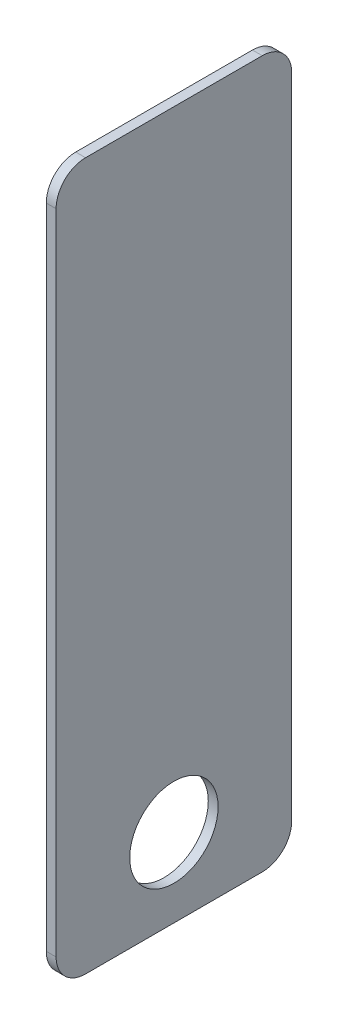
ISO-10303-21;
HEADER;
FILE_DESCRIPTION(('STEP AP214'),'2;1');
FILE_NAME('part.step','',(''),(''),'','','');
FILE_SCHEMA(('AUTOMOTIVE_DESIGN { 1 0 10303 214 1 1 1 1 }'));
ENDSEC;
DATA;
#1=APPLICATION_CONTEXT('core data for automotive mechanical design processes');
#2=APPLICATION_PROTOCOL_DEFINITION('international standard','automotive_design',2000,#1);
#3=PRODUCT_CONTEXT('',#1,'mechanical');
#4=PRODUCT('Part','Part','',(#3));
#5=PRODUCT_RELATED_PRODUCT_CATEGORY('part','',(#4));
#6=PRODUCT_DEFINITION_FORMATION('','',#4);
#7=PRODUCT_DEFINITION_CONTEXT('part definition',#1,'design');
#8=PRODUCT_DEFINITION('design','',#6,#7);
#9=PRODUCT_DEFINITION_SHAPE('','',#8);
#10=(LENGTH_UNIT() NAMED_UNIT(*) SI_UNIT(.MILLI.,.METRE.));
#11=(NAMED_UNIT(*) PLANE_ANGLE_UNIT() SI_UNIT($,.RADIAN.));
#12=(NAMED_UNIT(*) SI_UNIT($,.STERADIAN.) SOLID_ANGLE_UNIT());
#13=UNCERTAINTY_MEASURE_WITH_UNIT(LENGTH_MEASURE(1.E-05),#10,'distance_accuracy_value','');
#14=(GEOMETRIC_REPRESENTATION_CONTEXT(3) GLOBAL_UNCERTAINTY_ASSIGNED_CONTEXT((#13)) GLOBAL_UNIT_ASSIGNED_CONTEXT((#10,
#11,#12)) REPRESENTATION_CONTEXT('',''));
#15=CARTESIAN_POINT('',(0.,0.,0.));
#16=DIRECTION('',(0.,0.,1.));
#17=DIRECTION('',(1.,0.,0.));
#18=AXIS2_PLACEMENT_3D('',#15,#16,#17);
#19=CARTESIAN_POINT('',(3.175,0.,0.));
#20=DIRECTION('',(1.,0.,0.));
#21=DIRECTION('',(0.,0.,-1.));
#22=AXIS2_PLACEMENT_3D('',#19,#20,#21);
#23=PLANE('',#22);
#24=DIRECTION('',(0.,0.,-1.));
#25=VECTOR('',#24,1.);
#26=CARTESIAN_POINT('',(3.175,-114.3,38.1));
#27=LINE('',#26,#25);
#28=CARTESIAN_POINT('',(3.175,-114.3,28.575));
#29=VERTEX_POINT('',#28);
#30=CARTESIAN_POINT('',(3.175,-114.3,-28.575));
#31=VERTEX_POINT('',#30);
#32=EDGE_CURVE('E168',#29,#31,#27,.T.);
#33=ORIENTED_EDGE('',*,*,#32,.T.);
#34=CARTESIAN_POINT('',(3.175,-104.775,-28.575));
#35=DIRECTION('',(1.,0.,0.));
#36=DIRECTION('',(0.,0.,-1.));
#37=AXIS2_PLACEMENT_3D('',#34,#35,#36);
#38=CIRCLE('',#37,9.525);
#39=CARTESIAN_POINT('',(3.175,-104.775,-38.1));
#40=VERTEX_POINT('',#39);
#41=EDGE_CURVE('E148',#31,#40,#38,.T.);
#42=ORIENTED_EDGE('',*,*,#41,.T.);
#43=DIRECTION('',(0.,1.,0.));
#44=VECTOR('',#43,1.);
#45=CARTESIAN_POINT('',(3.175,114.3,-38.1));
#46=LINE('',#45,#44);
#47=CARTESIAN_POINT('',(3.175,104.775,-38.1));
#48=VERTEX_POINT('',#47);
#49=EDGE_CURVE('E118',#40,#48,#46,.T.);
#50=ORIENTED_EDGE('',*,*,#49,.T.);
#51=CARTESIAN_POINT('',(3.175,104.775,-28.575));
#52=DIRECTION('',(1.,0.,0.));
#53=DIRECTION('',(0.,0.,-1.));
#54=AXIS2_PLACEMENT_3D('',#51,#52,#53);
#55=CIRCLE('',#54,9.525);
#56=CARTESIAN_POINT('',(3.175,114.3,-28.575));
#57=VERTEX_POINT('',#56);
#58=EDGE_CURVE('E54',#48,#57,#55,.T.);
#59=ORIENTED_EDGE('',*,*,#58,.T.);
#60=DIRECTION('',(0.,0.,1.));
#61=VECTOR('',#60,1.);
#62=CARTESIAN_POINT('',(3.175,114.3,38.1));
#63=LINE('',#62,#61);
#64=CARTESIAN_POINT('',(3.175,114.3,28.575));
#65=VERTEX_POINT('',#64);
#66=EDGE_CURVE('E135',#57,#65,#63,.T.);
#67=ORIENTED_EDGE('',*,*,#66,.T.);
#68=CARTESIAN_POINT('',(3.175,104.775,28.575));
#69=DIRECTION('',(1.,0.,0.));
#70=DIRECTION('',(0.,0.,-1.));
#71=AXIS2_PLACEMENT_3D('',#68,#69,#70);
#72=CIRCLE('',#71,9.525);
#73=CARTESIAN_POINT('',(3.175,104.775,38.1));
#74=VERTEX_POINT('',#73);
#75=EDGE_CURVE('E143',#65,#74,#72,.T.);
#76=ORIENTED_EDGE('',*,*,#75,.T.);
#77=DIRECTION('',(0.,-1.,0.));
#78=VECTOR('',#77,1.);
#79=CARTESIAN_POINT('',(3.175,114.3,38.1));
#80=LINE('',#79,#78);
#81=CARTESIAN_POINT('',(3.175,-104.775,38.1));
#82=VERTEX_POINT('',#81);
#83=EDGE_CURVE('E129',#74,#82,#80,.T.);
#84=ORIENTED_EDGE('',*,*,#83,.T.);
#85=CARTESIAN_POINT('',(3.175,-104.775,28.575));
#86=DIRECTION('',(1.,0.,0.));
#87=DIRECTION('',(0.,0.,-1.));
#88=AXIS2_PLACEMENT_3D('',#85,#86,#87);
#89=CIRCLE('',#88,9.525);
#90=EDGE_CURVE('E146',#82,#29,#89,.T.);
#91=ORIENTED_EDGE('',*,*,#90,.T.);
#92=EDGE_LOOP('',(#33,#42,#50,#59,#67,#76,#84,#91));
#93=FACE_BOUND('',#92,.T.);
#94=CARTESIAN_POINT('',(3.175,-88.9,0.));
#95=DIRECTION('',(1.,0.,0.));
#96=DIRECTION('',(0.,0.,-1.));
#97=AXIS2_PLACEMENT_3D('',#94,#95,#96);
#98=CIRCLE('',#97,14.2875);
#99=CARTESIAN_POINT('',(3.175,-88.9,-14.2875));
#100=VERTEX_POINT('',#99);
#101=EDGE_CURVE('E174',#100,#100,#98,.T.);
#102=ORIENTED_EDGE('',*,*,#101,.F.);
#103=EDGE_LOOP('',(#102));
#104=FACE_BOUND('',#103,.T.);
#105=ADVANCED_FACE('F33',(#93,#104),#23,.T.);
#106=CARTESIAN_POINT('',(0.,0.,0.));
#107=DIRECTION('',(1.,0.,0.));
#108=DIRECTION('',(0.,0.,-1.));
#109=AXIS2_PLACEMENT_3D('',#106,#107,#108);
#110=PLANE('',#109);
#111=DIRECTION('',(0.,1.,0.));
#112=VECTOR('',#111,1.);
#113=CARTESIAN_POINT('',(0.,114.3,-38.1));
#114=LINE('',#113,#112);
#115=CARTESIAN_POINT('',(0.,-104.775,-38.1));
#116=VERTEX_POINT('',#115);
#117=CARTESIAN_POINT('',(0.,104.775,-38.1));
#118=VERTEX_POINT('',#117);
#119=EDGE_CURVE('E116',#116,#118,#114,.T.);
#120=ORIENTED_EDGE('',*,*,#119,.F.);
#121=CARTESIAN_POINT('',(0.,-104.775,-28.575));
#122=DIRECTION('',(1.,0.,0.));
#123=DIRECTION('',(0.,0.,-1.));
#124=AXIS2_PLACEMENT_3D('',#121,#122,#123);
#125=CIRCLE('',#124,9.525);
#126=CARTESIAN_POINT('',(0.,-114.3,-28.575));
#127=VERTEX_POINT('',#126);
#128=EDGE_CURVE('E99',#116,#127,#125,.F.);
#129=ORIENTED_EDGE('',*,*,#128,.T.);
#130=DIRECTION('',(0.,0.,-1.));
#131=VECTOR('',#130,1.);
#132=CARTESIAN_POINT('',(0.,-114.3,38.1));
#133=LINE('',#132,#131);
#134=CARTESIAN_POINT('',(0.,-114.3,28.575));
#135=VERTEX_POINT('',#134);
#136=EDGE_CURVE('E127',#135,#127,#133,.T.);
#137=ORIENTED_EDGE('',*,*,#136,.F.);
#138=CARTESIAN_POINT('',(0.,-104.775,28.575));
#139=DIRECTION('',(1.,0.,0.));
#140=DIRECTION('',(0.,0.,-1.));
#141=AXIS2_PLACEMENT_3D('',#138,#139,#140);
#142=CIRCLE('',#141,9.525);
#143=CARTESIAN_POINT('',(0.,-104.775,38.1));
#144=VERTEX_POINT('',#143);
#145=EDGE_CURVE('E110',#135,#144,#142,.F.);
#146=ORIENTED_EDGE('',*,*,#145,.T.);
#147=DIRECTION('',(0.,-1.,0.));
#148=VECTOR('',#147,1.);
#149=CARTESIAN_POINT('',(0.,114.3,38.1));
#150=LINE('',#149,#148);
#151=CARTESIAN_POINT('',(0.,104.775,38.1));
#152=VERTEX_POINT('',#151);
#153=EDGE_CURVE('E131',#152,#144,#150,.T.);
#154=ORIENTED_EDGE('',*,*,#153,.F.);
#155=CARTESIAN_POINT('',(0.,104.775,28.575));
#156=DIRECTION('',(1.,0.,0.));
#157=DIRECTION('',(0.,0.,-1.));
#158=AXIS2_PLACEMENT_3D('',#155,#156,#157);
#159=CIRCLE('',#158,9.525);
#160=CARTESIAN_POINT('',(0.,114.3,28.575));
#161=VERTEX_POINT('',#160);
#162=EDGE_CURVE('E119',#152,#161,#159,.F.);
#163=ORIENTED_EDGE('',*,*,#162,.T.);
#164=DIRECTION('',(0.,0.,1.));
#165=VECTOR('',#164,1.);
#166=CARTESIAN_POINT('',(0.,114.3,38.1));
#167=LINE('',#166,#165);
#168=CARTESIAN_POINT('',(0.,114.3,-28.575));
#169=VERTEX_POINT('',#168);
#170=EDGE_CURVE('E126',#169,#161,#167,.T.);
#171=ORIENTED_EDGE('',*,*,#170,.F.);
#172=CARTESIAN_POINT('',(0.,104.775,-28.575));
#173=DIRECTION('',(1.,0.,0.));
#174=DIRECTION('',(0.,0.,-1.));
#175=AXIS2_PLACEMENT_3D('',#172,#173,#174);
#176=CIRCLE('',#175,9.525);
#177=EDGE_CURVE('E125',#169,#118,#176,.F.);
#178=ORIENTED_EDGE('',*,*,#177,.T.);
#179=EDGE_LOOP('',(#120,#129,#137,#146,#154,#163,#171,#178));
#180=FACE_BOUND('',#179,.T.);
#181=CARTESIAN_POINT('',(0.,-88.9,0.));
#182=DIRECTION('',(1.,0.,0.));
#183=DIRECTION('',(0.,0.,-1.));
#184=AXIS2_PLACEMENT_3D('',#181,#182,#183);
#185=CIRCLE('',#184,14.2875);
#186=CARTESIAN_POINT('',(0.,-88.9,-14.2875));
#187=VERTEX_POINT('',#186);
#188=EDGE_CURVE('E176',#187,#187,#185,.T.);
#189=ORIENTED_EDGE('',*,*,#188,.T.);
#190=EDGE_LOOP('',(#189));
#191=FACE_BOUND('',#190,.T.);
#192=ADVANCED_FACE('F122',(#180,#191),#110,.F.);
#193=CARTESIAN_POINT('',(3.175,114.3,38.1));
#194=DIRECTION('',(0.,0.,-1.));
#195=DIRECTION('',(-1.,0.,0.));
#196=AXIS2_PLACEMENT_3D('',#193,#194,#195);
#197=PLANE('',#196);
#198=ORIENTED_EDGE('',*,*,#153,.T.);
#199=DIRECTION('',(-1.,0.,0.));
#200=VECTOR('',#199,1.);
#201=CARTESIAN_POINT('',(3.175,-104.775,38.1));
#202=LINE('',#201,#200);
#203=EDGE_CURVE('E153',#144,#82,#202,.F.);
#204=ORIENTED_EDGE('',*,*,#203,.T.);
#205=ORIENTED_EDGE('',*,*,#83,.F.);
#206=DIRECTION('',(-1.,0.,0.));
#207=VECTOR('',#206,1.);
#208=CARTESIAN_POINT('',(3.175,104.775,38.1));
#209=LINE('',#208,#207);
#210=EDGE_CURVE('E150',#74,#152,#209,.T.);
#211=ORIENTED_EDGE('',*,*,#210,.T.);
#212=EDGE_LOOP('',(#198,#204,#205,#211));
#213=FACE_BOUND('',#212,.T.);
#214=ADVANCED_FACE('F159',(#213),#197,.F.);
#215=CARTESIAN_POINT('',(3.175,-114.3,38.1));
#216=DIRECTION('',(0.,1.,0.));
#217=DIRECTION('',(0.,0.,1.));
#218=AXIS2_PLACEMENT_3D('',#215,#216,#217);
#219=PLANE('',#218);
#220=ORIENTED_EDGE('',*,*,#136,.T.);
#221=DIRECTION('',(-1.,0.,0.));
#222=VECTOR('',#221,1.);
#223=CARTESIAN_POINT('',(3.175,-114.3,-28.575));
#224=LINE('',#223,#222);
#225=EDGE_CURVE('E104',#127,#31,#224,.F.);
#226=ORIENTED_EDGE('',*,*,#225,.T.);
#227=ORIENTED_EDGE('',*,*,#32,.F.);
#228=DIRECTION('',(-1.,0.,0.));
#229=VECTOR('',#228,1.);
#230=CARTESIAN_POINT('',(3.175,-114.3,28.575));
#231=LINE('',#230,#229);
#232=EDGE_CURVE('E109',#29,#135,#231,.T.);
#233=ORIENTED_EDGE('',*,*,#232,.T.);
#234=EDGE_LOOP('',(#220,#226,#227,#233));
#235=FACE_BOUND('',#234,.T.);
#236=ADVANCED_FACE('F173',(#235),#219,.F.);
#237=CARTESIAN_POINT('',(3.175,114.3,-38.1));
#238=DIRECTION('',(0.,0.,1.));
#239=DIRECTION('',(0.,-1.,0.));
#240=AXIS2_PLACEMENT_3D('',#237,#238,#239);
#241=PLANE('',#240);
#242=ORIENTED_EDGE('',*,*,#49,.F.);
#243=DIRECTION('',(-1.,0.,0.));
#244=VECTOR('',#243,1.);
#245=CARTESIAN_POINT('',(3.175,-104.775,-38.1));
#246=LINE('',#245,#244);
#247=EDGE_CURVE('E103',#40,#116,#246,.T.);
#248=ORIENTED_EDGE('',*,*,#247,.T.);
#249=ORIENTED_EDGE('',*,*,#119,.T.);
#250=DIRECTION('',(-1.,0.,0.));
#251=VECTOR('',#250,1.);
#252=CARTESIAN_POINT('',(3.175,104.775,-38.1));
#253=LINE('',#252,#251);
#254=EDGE_CURVE('E120',#118,#48,#253,.F.);
#255=ORIENTED_EDGE('',*,*,#254,.T.);
#256=EDGE_LOOP('',(#242,#248,#249,#255));
#257=FACE_BOUND('',#256,.T.);
#258=ADVANCED_FACE('F115',(#257),#241,.F.);
#259=CARTESIAN_POINT('',(3.175,114.3,38.1));
#260=DIRECTION('',(0.,-1.,0.));
#261=DIRECTION('',(0.,0.,-1.));
#262=AXIS2_PLACEMENT_3D('',#259,#260,#261);
#263=PLANE('',#262);
#264=ORIENTED_EDGE('',*,*,#66,.F.);
#265=DIRECTION('',(-1.,0.,0.));
#266=VECTOR('',#265,1.);
#267=CARTESIAN_POINT('',(3.175,114.3,-28.575));
#268=LINE('',#267,#266);
#269=EDGE_CURVE('E11',#57,#169,#268,.T.);
#270=ORIENTED_EDGE('',*,*,#269,.T.);
#271=ORIENTED_EDGE('',*,*,#170,.T.);
#272=DIRECTION('',(-1.,0.,0.));
#273=VECTOR('',#272,1.);
#274=CARTESIAN_POINT('',(3.175,114.3,28.575));
#275=LINE('',#274,#273);
#276=EDGE_CURVE('E41',#161,#65,#275,.F.);
#277=ORIENTED_EDGE('',*,*,#276,.T.);
#278=EDGE_LOOP('',(#264,#270,#271,#277));
#279=FACE_BOUND('',#278,.T.);
#280=ADVANCED_FACE('F187',(#279),#263,.F.);
#281=CARTESIAN_POINT('',(3.175,-88.9,0.));
#282=DIRECTION('',(-1.,0.,0.));
#283=DIRECTION('',(0.,0.,1.));
#284=AXIS2_PLACEMENT_3D('',#281,#282,#283);
#285=CYLINDRICAL_SURFACE('',#284,14.2875);
#286=ORIENTED_EDGE('',*,*,#101,.T.);
#287=EDGE_LOOP('',(#286));
#288=FACE_BOUND('',#287,.T.);
#289=ORIENTED_EDGE('',*,*,#188,.F.);
#290=EDGE_LOOP('',(#289));
#291=FACE_BOUND('',#290,.T.);
#292=ADVANCED_FACE('F185',(#288,#291),#285,.F.);
#293=CARTESIAN_POINT('',(3.175,-104.775,-28.575));
#294=DIRECTION('',(-1.,0.,0.));
#295=DIRECTION('',(0.,0.,1.));
#296=AXIS2_PLACEMENT_3D('',#293,#294,#295);
#297=CYLINDRICAL_SURFACE('',#296,9.525);
#298=ORIENTED_EDGE('',*,*,#41,.F.);
#299=ORIENTED_EDGE('',*,*,#225,.F.);
#300=ORIENTED_EDGE('',*,*,#128,.F.);
#301=ORIENTED_EDGE('',*,*,#247,.F.);
#302=EDGE_LOOP('',(#298,#299,#300,#301));
#303=FACE_BOUND('',#302,.T.);
#304=ADVANCED_FACE('F102',(#303),#297,.T.);
#305=CARTESIAN_POINT('',(3.175,-104.775,28.575));
#306=DIRECTION('',(-1.,0.,0.));
#307=DIRECTION('',(0.,0.,1.));
#308=AXIS2_PLACEMENT_3D('',#305,#306,#307);
#309=CYLINDRICAL_SURFACE('',#308,9.525);
#310=ORIENTED_EDGE('',*,*,#90,.F.);
#311=ORIENTED_EDGE('',*,*,#203,.F.);
#312=ORIENTED_EDGE('',*,*,#145,.F.);
#313=ORIENTED_EDGE('',*,*,#232,.F.);
#314=EDGE_LOOP('',(#310,#311,#312,#313));
#315=FACE_BOUND('',#314,.T.);
#316=ADVANCED_FACE('F171',(#315),#309,.T.);
#317=CARTESIAN_POINT('',(3.175,104.775,-28.575));
#318=DIRECTION('',(-1.,0.,0.));
#319=DIRECTION('',(0.,0.,1.));
#320=AXIS2_PLACEMENT_3D('',#317,#318,#319);
#321=CYLINDRICAL_SURFACE('',#320,9.525);
#322=ORIENTED_EDGE('',*,*,#58,.F.);
#323=ORIENTED_EDGE('',*,*,#254,.F.);
#324=ORIENTED_EDGE('',*,*,#177,.F.);
#325=ORIENTED_EDGE('',*,*,#269,.F.);
#326=EDGE_LOOP('',(#322,#323,#324,#325));
#327=FACE_BOUND('',#326,.T.);
#328=ADVANCED_FACE('F210',(#327),#321,.T.);
#329=CARTESIAN_POINT('',(3.175,104.775,28.575));
#330=DIRECTION('',(-1.,0.,0.));
#331=DIRECTION('',(0.,0.,1.));
#332=AXIS2_PLACEMENT_3D('',#329,#330,#331);
#333=CYLINDRICAL_SURFACE('',#332,9.525);
#334=ORIENTED_EDGE('',*,*,#75,.F.);
#335=ORIENTED_EDGE('',*,*,#276,.F.);
#336=ORIENTED_EDGE('',*,*,#162,.F.);
#337=ORIENTED_EDGE('',*,*,#210,.F.);
#338=EDGE_LOOP('',(#334,#335,#336,#337));
#339=FACE_BOUND('',#338,.T.);
#340=ADVANCED_FACE('F35',(#339),#333,.T.);
#341=CLOSED_SHELL('',(#105,#192,#214,#236,#258,#280,#292,#304,#316,#328,#340));
#342=MANIFOLD_SOLID_BREP('B2',#341);
#343=ADVANCED_BREP_SHAPE_REPRESENTATION('',(#18,#342),#14);
#344=SHAPE_DEFINITION_REPRESENTATION(#9,#343);
ENDSEC;
END-ISO-10303-21;
